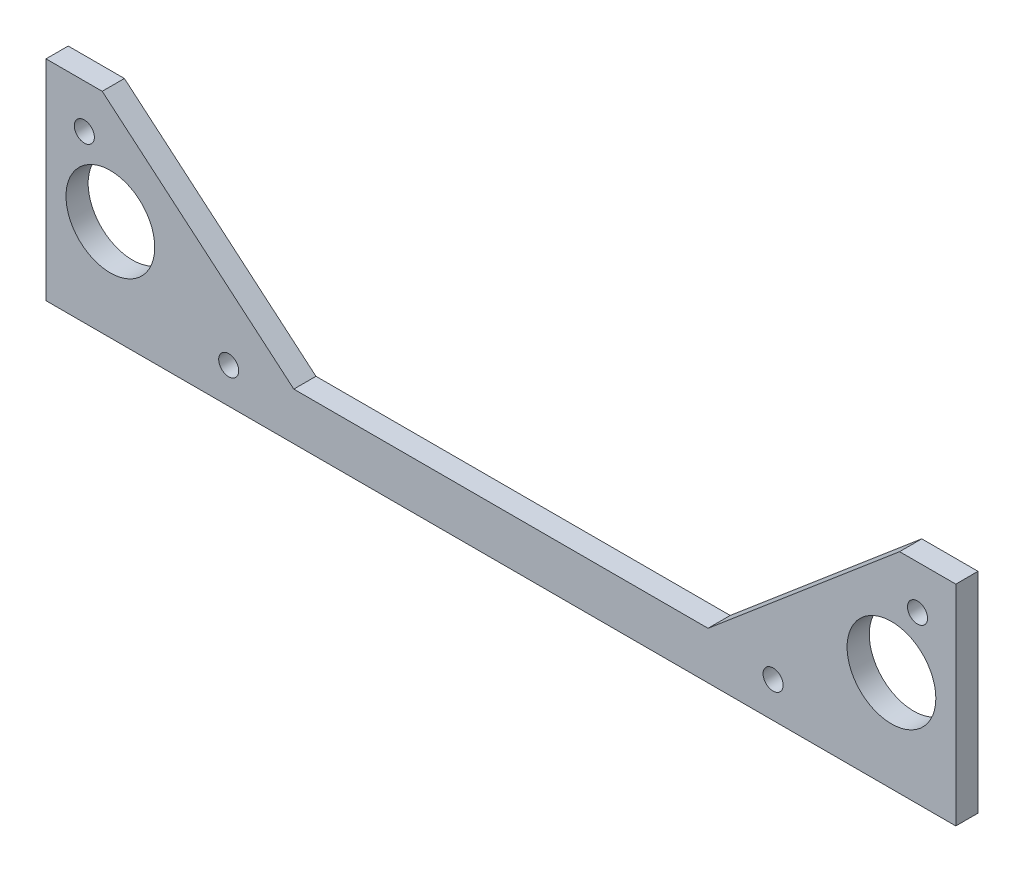
ISO-10303-21;
HEADER;
FILE_DESCRIPTION(('STEP AP214'),'2;1');
FILE_NAME('part.step','',(''),(''),'','','');
FILE_SCHEMA(('AUTOMOTIVE_DESIGN { 1 0 10303 214 1 1 1 1 }'));
ENDSEC;
DATA;
#1=APPLICATION_CONTEXT('core data for automotive mechanical design processes');
#2=APPLICATION_PROTOCOL_DEFINITION('international standard','automotive_design',2000,#1);
#3=PRODUCT_CONTEXT('',#1,'mechanical');
#4=PRODUCT('Part','Part','',(#3));
#5=PRODUCT_RELATED_PRODUCT_CATEGORY('part','',(#4));
#6=PRODUCT_DEFINITION_FORMATION('','',#4);
#7=PRODUCT_DEFINITION_CONTEXT('part definition',#1,'design');
#8=PRODUCT_DEFINITION('design','',#6,#7);
#9=PRODUCT_DEFINITION_SHAPE('','',#8);
#10=(LENGTH_UNIT() NAMED_UNIT(*) SI_UNIT(.MILLI.,.METRE.));
#11=(NAMED_UNIT(*) PLANE_ANGLE_UNIT() SI_UNIT($,.RADIAN.));
#12=(NAMED_UNIT(*) SI_UNIT($,.STERADIAN.) SOLID_ANGLE_UNIT());
#13=UNCERTAINTY_MEASURE_WITH_UNIT(LENGTH_MEASURE(1.E-05),#10,'distance_accuracy_value','');
#14=(GEOMETRIC_REPRESENTATION_CONTEXT(3) GLOBAL_UNCERTAINTY_ASSIGNED_CONTEXT((#13)) GLOBAL_UNIT_ASSIGNED_CONTEXT((#10,
#11,#12)) REPRESENTATION_CONTEXT('',''));
#15=CARTESIAN_POINT('',(0.,0.,0.));
#16=DIRECTION('',(0.,0.,1.));
#17=DIRECTION('',(1.,0.,0.));
#18=AXIS2_PLACEMENT_3D('',#15,#16,#17);
#19=CARTESIAN_POINT('',(0.,0.,4.7625));
#20=DIRECTION('',(0.,0.,1.));
#21=DIRECTION('',(1.,0.,0.));
#22=AXIS2_PLACEMENT_3D('',#19,#20,#21);
#23=PLANE('',#22);
#24=CARTESIAN_POINT('',(89.4079999999999,35.5599999999978,4.7625));
#25=DIRECTION('',(0.,0.,1.));
#26=DIRECTION('',(1.,0.,0.));
#27=AXIS2_PLACEMENT_3D('',#24,#25,#26);
#28=CIRCLE('',#27,2.15264999999999);
#29=CARTESIAN_POINT('',(91.5606499999999,35.5599999999978,4.7625));
#30=VERTEX_POINT('',#29);
#31=EDGE_CURVE('E227',#30,#30,#28,.T.);
#32=ORIENTED_EDGE('',*,*,#31,.F.);
#33=EDGE_LOOP('',(#32));
#34=FACE_BOUND('',#33,.T.);
#35=CARTESIAN_POINT('',(58.4199999999999,7.61999999999863,4.7625));
#36=DIRECTION('',(0.,0.,1.));
#37=DIRECTION('',(1.,0.,0.));
#38=AXIS2_PLACEMENT_3D('',#35,#36,#37);
#39=CIRCLE('',#38,2.15264999999999);
#40=CARTESIAN_POINT('',(60.5726499999999,7.61999999999863,4.7625));
#41=VERTEX_POINT('',#40);
#42=EDGE_CURVE('E221',#41,#41,#39,.T.);
#43=ORIENTED_EDGE('',*,*,#42,.F.);
#44=EDGE_LOOP('',(#43));
#45=FACE_BOUND('',#44,.T.);
#46=CARTESIAN_POINT('',(-58.4199999999996,7.61999999999818,4.7625));
#47=DIRECTION('',(0.,0.,1.));
#48=DIRECTION('',(1.,0.,0.));
#49=AXIS2_PLACEMENT_3D('',#46,#47,#48);
#50=CIRCLE('',#49,2.15264999999999);
#51=CARTESIAN_POINT('',(-56.2673499999996,7.61999999999818,4.7625));
#52=VERTEX_POINT('',#51);
#53=EDGE_CURVE('E215',#52,#52,#50,.T.);
#54=ORIENTED_EDGE('',*,*,#53,.F.);
#55=EDGE_LOOP('',(#54));
#56=FACE_BOUND('',#55,.T.);
#57=CARTESIAN_POINT('',(-89.4080000000001,35.5599999999978,4.7625));
#58=DIRECTION('',(0.,0.,1.));
#59=DIRECTION('',(1.,0.,0.));
#60=AXIS2_PLACEMENT_3D('',#57,#58,#59);
#61=CIRCLE('',#60,2.15264999999999);
#62=CARTESIAN_POINT('',(-87.2553500000001,35.5599999999978,4.7625));
#63=VERTEX_POINT('',#62);
#64=EDGE_CURVE('E209',#63,#63,#61,.T.);
#65=ORIENTED_EDGE('',*,*,#64,.F.);
#66=EDGE_LOOP('',(#65));
#67=FACE_BOUND('',#66,.T.);
#68=CARTESIAN_POINT('',(-83.8200000000003,21.5899999999987,4.7625));
#69=DIRECTION('',(0.,0.,1.));
#70=DIRECTION('',(1.,0.,0.));
#71=AXIS2_PLACEMENT_3D('',#68,#69,#70);
#72=CIRCLE('',#71,9.52500000000001);
#73=CARTESIAN_POINT('',(-74.2950000000003,21.5899999999987,4.7625));
#74=VERTEX_POINT('',#73);
#75=EDGE_CURVE('E150',#74,#74,#72,.T.);
#76=ORIENTED_EDGE('',*,*,#75,.F.);
#77=EDGE_LOOP('',(#76));
#78=FACE_BOUND('',#77,.T.);
#79=DIRECTION('',(-1.,0.,0.));
#80=VECTOR('',#79,1.);
#81=CARTESIAN_POINT('',(44.45,10.1599999999982,4.7625));
#82=LINE('',#81,#80);
#83=CARTESIAN_POINT('',(44.45,10.1599999999982,4.7625));
#84=VERTEX_POINT('',#83);
#85=CARTESIAN_POINT('',(-44.45,10.1599999999982,4.7625));
#86=VERTEX_POINT('',#85);
#87=EDGE_CURVE('E161',#84,#86,#82,.T.);
#88=ORIENTED_EDGE('',*,*,#87,.T.);
#89=DIRECTION('',(-0.763319207538048,0.646021506920232,0.));
#90=VECTOR('',#89,1.);
#91=CARTESIAN_POINT('',(-44.45,10.1599999999982,4.7625));
#92=LINE('',#91,#90);
#93=CARTESIAN_POINT('',(-85.5662500000001,44.9579999999982,4.7625));
#94=VERTEX_POINT('',#93);
#95=EDGE_CURVE('E109',#86,#94,#92,.T.);
#96=ORIENTED_EDGE('',*,*,#95,.T.);
#97=DIRECTION('',(-1.,0.,0.));
#98=VECTOR('',#97,1.);
#99=CARTESIAN_POINT('',(-85.5662500000001,44.9579999999982,4.7625));
#100=LINE('',#99,#98);
#101=CARTESIAN_POINT('',(-97.6312500000001,44.9579999999982,4.7625));
#102=VERTEX_POINT('',#101);
#103=EDGE_CURVE('E176',#94,#102,#100,.T.);
#104=ORIENTED_EDGE('',*,*,#103,.T.);
#105=DIRECTION('',(0.,-1.,0.));
#106=VECTOR('',#105,1.);
#107=CARTESIAN_POINT('',(-97.6312500000001,44.9579999999982,4.7625));
#108=LINE('',#107,#106);
#109=CARTESIAN_POINT('',(-97.6312500000002,-1.7837229068974E-12,4.7625));
#110=VERTEX_POINT('',#109);
#111=EDGE_CURVE('E189',#102,#110,#108,.T.);
#112=ORIENTED_EDGE('',*,*,#111,.T.);
#113=DIRECTION('',(1.,0.,0.));
#114=VECTOR('',#113,1.);
#115=CARTESIAN_POINT('',(-97.6312500000002,-1.7837229068974E-12,4.7625));
#116=LINE('',#115,#114);
#117=CARTESIAN_POINT('',(97.6312499999999,-1.76793328447214E-12,4.7625));
#118=VERTEX_POINT('',#117);
#119=EDGE_CURVE('E128',#110,#118,#116,.T.);
#120=ORIENTED_EDGE('',*,*,#119,.T.);
#121=DIRECTION('',(0.,1.,0.));
#122=VECTOR('',#121,1.);
#123=CARTESIAN_POINT('',(97.6312499999999,-1.76793328447214E-12,4.7625));
#124=LINE('',#123,#122);
#125=CARTESIAN_POINT('',(97.6312499999999,44.9579999999982,4.7625));
#126=VERTEX_POINT('',#125);
#127=EDGE_CURVE('E122',#118,#126,#124,.T.);
#128=ORIENTED_EDGE('',*,*,#127,.T.);
#129=DIRECTION('',(-1.,0.,0.));
#130=VECTOR('',#129,1.);
#131=CARTESIAN_POINT('',(97.6312499999999,44.9579999999982,4.7625));
#132=LINE('',#131,#130);
#133=CARTESIAN_POINT('',(85.5662499999999,44.9579999999982,4.7625));
#134=VERTEX_POINT('',#133);
#135=EDGE_CURVE('E126',#126,#134,#132,.T.);
#136=ORIENTED_EDGE('',*,*,#135,.T.);
#137=DIRECTION('',(-0.763319207538048,-0.646021506920232,0.));
#138=VECTOR('',#137,1.);
#139=CARTESIAN_POINT('',(85.5662499999999,44.9579999999982,4.7625));
#140=LINE('',#139,#138);
#141=EDGE_CURVE('E66',#134,#84,#140,.T.);
#142=ORIENTED_EDGE('',*,*,#141,.T.);
#143=EDGE_LOOP('',(#88,#96,#104,#112,#120,#128,#136,#142));
#144=FACE_BOUND('',#143,.T.);
#145=CARTESIAN_POINT('',(83.8199999999999,21.5899999999984,4.7625));
#146=DIRECTION('',(0.,0.,1.));
#147=DIRECTION('',(1.,0.,0.));
#148=AXIS2_PLACEMENT_3D('',#145,#146,#147);
#149=CIRCLE('',#148,9.52500000000001);
#150=CARTESIAN_POINT('',(93.3449999999999,21.5899999999984,4.7625));
#151=VERTEX_POINT('',#150);
#152=EDGE_CURVE('E198',#151,#151,#149,.T.);
#153=ORIENTED_EDGE('',*,*,#152,.F.);
#154=EDGE_LOOP('',(#153));
#155=FACE_BOUND('',#154,.T.);
#156=ADVANCED_FACE('F49',(#34,#45,#56,#67,#78,#144,#155),#23,.T.);
#157=CARTESIAN_POINT('',(0.,0.,0.));
#158=DIRECTION('',(0.,0.,1.));
#159=DIRECTION('',(1.,0.,0.));
#160=AXIS2_PLACEMENT_3D('',#157,#158,#159);
#161=PLANE('',#160);
#162=CARTESIAN_POINT('',(89.4079999999999,35.5599999999978,0.));
#163=DIRECTION('',(0.,0.,1.));
#164=DIRECTION('',(1.,0.,0.));
#165=AXIS2_PLACEMENT_3D('',#162,#163,#164);
#166=CIRCLE('',#165,2.15264999999999);
#167=CARTESIAN_POINT('',(91.5606499999999,35.5599999999978,0.));
#168=VERTEX_POINT('',#167);
#169=EDGE_CURVE('E224',#168,#168,#166,.T.);
#170=ORIENTED_EDGE('',*,*,#169,.T.);
#171=EDGE_LOOP('',(#170));
#172=FACE_BOUND('',#171,.T.);
#173=CARTESIAN_POINT('',(58.4199999999999,7.61999999999863,0.));
#174=DIRECTION('',(0.,0.,1.));
#175=DIRECTION('',(1.,0.,0.));
#176=AXIS2_PLACEMENT_3D('',#173,#174,#175);
#177=CIRCLE('',#176,2.15265);
#178=CARTESIAN_POINT('',(60.5726499999999,7.61999999999863,0.));
#179=VERTEX_POINT('',#178);
#180=EDGE_CURVE('E218',#179,#179,#177,.T.);
#181=ORIENTED_EDGE('',*,*,#180,.T.);
#182=EDGE_LOOP('',(#181));
#183=FACE_BOUND('',#182,.T.);
#184=CARTESIAN_POINT('',(-58.4199999999996,7.61999999999818,0.));
#185=DIRECTION('',(0.,0.,1.));
#186=DIRECTION('',(1.,0.,0.));
#187=AXIS2_PLACEMENT_3D('',#184,#185,#186);
#188=CIRCLE('',#187,2.15265);
#189=CARTESIAN_POINT('',(-56.2673499999996,7.61999999999818,0.));
#190=VERTEX_POINT('',#189);
#191=EDGE_CURVE('E212',#190,#190,#188,.T.);
#192=ORIENTED_EDGE('',*,*,#191,.T.);
#193=EDGE_LOOP('',(#192));
#194=FACE_BOUND('',#193,.T.);
#195=CARTESIAN_POINT('',(-89.4080000000001,35.5599999999978,0.));
#196=DIRECTION('',(0.,0.,1.));
#197=DIRECTION('',(1.,0.,0.));
#198=AXIS2_PLACEMENT_3D('',#195,#196,#197);
#199=CIRCLE('',#198,2.15264999999999);
#200=CARTESIAN_POINT('',(-87.2553500000001,35.5599999999978,0.));
#201=VERTEX_POINT('',#200);
#202=EDGE_CURVE('E204',#201,#201,#199,.T.);
#203=ORIENTED_EDGE('',*,*,#202,.T.);
#204=EDGE_LOOP('',(#203));
#205=FACE_BOUND('',#204,.T.);
#206=DIRECTION('',(-1.,0.,0.));
#207=VECTOR('',#206,1.);
#208=CARTESIAN_POINT('',(44.45,10.1599999999982,0.));
#209=LINE('',#208,#207);
#210=CARTESIAN_POINT('',(44.45,10.1599999999982,0.));
#211=VERTEX_POINT('',#210);
#212=CARTESIAN_POINT('',(-44.45,10.1599999999982,0.));
#213=VERTEX_POINT('',#212);
#214=EDGE_CURVE('E146',#211,#213,#209,.T.);
#215=ORIENTED_EDGE('',*,*,#214,.F.);
#216=DIRECTION('',(-0.763319207538048,-0.646021506920232,0.));
#217=VECTOR('',#216,1.);
#218=CARTESIAN_POINT('',(85.5662499999999,44.9579999999982,0.));
#219=LINE('',#218,#217);
#220=CARTESIAN_POINT('',(85.5662499999999,44.9579999999982,0.));
#221=VERTEX_POINT('',#220);
#222=EDGE_CURVE('E101',#221,#211,#219,.T.);
#223=ORIENTED_EDGE('',*,*,#222,.F.);
#224=DIRECTION('',(-1.,0.,0.));
#225=VECTOR('',#224,1.);
#226=CARTESIAN_POINT('',(97.6312499999999,44.9579999999982,0.));
#227=LINE('',#226,#225);
#228=CARTESIAN_POINT('',(97.6312499999999,44.9579999999982,0.));
#229=VERTEX_POINT('',#228);
#230=EDGE_CURVE('E95',#229,#221,#227,.T.);
#231=ORIENTED_EDGE('',*,*,#230,.F.);
#232=DIRECTION('',(0.,1.,0.));
#233=VECTOR('',#232,1.);
#234=CARTESIAN_POINT('',(97.6312499999999,-1.76793328447214E-12,0.));
#235=LINE('',#234,#233);
#236=CARTESIAN_POINT('',(97.6312499999999,-1.76793328447214E-12,0.));
#237=VERTEX_POINT('',#236);
#238=EDGE_CURVE('E136',#237,#229,#235,.T.);
#239=ORIENTED_EDGE('',*,*,#238,.F.);
#240=DIRECTION('',(1.,0.,0.));
#241=VECTOR('',#240,1.);
#242=CARTESIAN_POINT('',(-97.6312500000002,-1.7837229068974E-12,0.));
#243=LINE('',#242,#241);
#244=CARTESIAN_POINT('',(-97.6312500000002,-1.7837229068974E-12,0.));
#245=VERTEX_POINT('',#244);
#246=EDGE_CURVE('E156',#245,#237,#243,.T.);
#247=ORIENTED_EDGE('',*,*,#246,.F.);
#248=DIRECTION('',(0.,-1.,0.));
#249=VECTOR('',#248,1.);
#250=CARTESIAN_POINT('',(-97.6312500000001,44.9579999999982,0.));
#251=LINE('',#250,#249);
#252=CARTESIAN_POINT('',(-97.6312500000001,44.9579999999982,0.));
#253=VERTEX_POINT('',#252);
#254=EDGE_CURVE('E154',#253,#245,#251,.T.);
#255=ORIENTED_EDGE('',*,*,#254,.F.);
#256=DIRECTION('',(-1.,0.,0.));
#257=VECTOR('',#256,1.);
#258=CARTESIAN_POINT('',(-85.5662500000001,44.9579999999982,0.));
#259=LINE('',#258,#257);
#260=CARTESIAN_POINT('',(-85.5662500000001,44.9579999999982,0.));
#261=VERTEX_POINT('',#260);
#262=EDGE_CURVE('E152',#261,#253,#259,.T.);
#263=ORIENTED_EDGE('',*,*,#262,.F.);
#264=DIRECTION('',(-0.763319207538048,0.646021506920232,0.));
#265=VECTOR('',#264,1.);
#266=CARTESIAN_POINT('',(-44.45,10.1599999999982,0.));
#267=LINE('',#266,#265);
#268=EDGE_CURVE('E149',#213,#261,#267,.T.);
#269=ORIENTED_EDGE('',*,*,#268,.F.);
#270=EDGE_LOOP('',(#215,#223,#231,#239,#247,#255,#263,#269));
#271=FACE_BOUND('',#270,.T.);
#272=CARTESIAN_POINT('',(-83.8200000000003,21.5899999999987,0.));
#273=DIRECTION('',(0.,0.,1.));
#274=DIRECTION('',(1.,0.,0.));
#275=AXIS2_PLACEMENT_3D('',#272,#273,#274);
#276=CIRCLE('',#275,9.52500000000001);
#277=CARTESIAN_POINT('',(-74.2950000000003,21.5899999999987,0.));
#278=VERTEX_POINT('',#277);
#279=EDGE_CURVE('E195',#278,#278,#276,.T.);
#280=ORIENTED_EDGE('',*,*,#279,.T.);
#281=EDGE_LOOP('',(#280));
#282=FACE_BOUND('',#281,.T.);
#283=CARTESIAN_POINT('',(83.8199999999999,21.5899999999984,0.));
#284=DIRECTION('',(0.,0.,1.));
#285=DIRECTION('',(1.,0.,0.));
#286=AXIS2_PLACEMENT_3D('',#283,#284,#285);
#287=CIRCLE('',#286,9.52500000000001);
#288=CARTESIAN_POINT('',(93.3449999999999,21.5899999999984,0.));
#289=VERTEX_POINT('',#288);
#290=EDGE_CURVE('E201',#289,#289,#287,.T.);
#291=ORIENTED_EDGE('',*,*,#290,.T.);
#292=EDGE_LOOP('',(#291));
#293=FACE_BOUND('',#292,.T.);
#294=ADVANCED_FACE('F180',(#172,#183,#194,#205,#271,#282,#293),#161,.F.);
#295=CARTESIAN_POINT('',(44.45,10.1599999999982,4.7625));
#296=DIRECTION('',(0.,-1.,0.));
#297=DIRECTION('',(1.,0.,0.));
#298=AXIS2_PLACEMENT_3D('',#295,#296,#297);
#299=PLANE('',#298);
#300=ORIENTED_EDGE('',*,*,#214,.T.);
#301=DIRECTION('',(0.,0.,-1.));
#302=VECTOR('',#301,1.);
#303=CARTESIAN_POINT('',(-44.45,10.1599999999982,4.7625));
#304=LINE('',#303,#302);
#305=EDGE_CURVE('E13',#86,#213,#304,.T.);
#306=ORIENTED_EDGE('',*,*,#305,.F.);
#307=ORIENTED_EDGE('',*,*,#87,.F.);
#308=DIRECTION('',(0.,0.,-1.));
#309=VECTOR('',#308,1.);
#310=CARTESIAN_POINT('',(44.45,10.1599999999982,4.7625));
#311=LINE('',#310,#309);
#312=EDGE_CURVE('E142',#84,#211,#311,.T.);
#313=ORIENTED_EDGE('',*,*,#312,.T.);
#314=EDGE_LOOP('',(#300,#306,#307,#313));
#315=FACE_BOUND('',#314,.T.);
#316=ADVANCED_FACE('F51',(#315),#299,.F.);
#317=CARTESIAN_POINT('',(-44.45,10.1599999999982,4.7625));
#318=DIRECTION('',(-0.646021506920232,-0.763319207538048,0.));
#319=DIRECTION('',(0.763319207538048,-0.646021506920232,0.));
#320=AXIS2_PLACEMENT_3D('',#317,#318,#319);
#321=PLANE('',#320);
#322=ORIENTED_EDGE('',*,*,#268,.T.);
#323=DIRECTION('',(0.,0.,-1.));
#324=VECTOR('',#323,1.);
#325=CARTESIAN_POINT('',(-85.5662500000001,44.9579999999982,4.7625));
#326=LINE('',#325,#324);
#327=EDGE_CURVE('E58',#94,#261,#326,.T.);
#328=ORIENTED_EDGE('',*,*,#327,.F.);
#329=ORIENTED_EDGE('',*,*,#95,.F.);
#330=ORIENTED_EDGE('',*,*,#305,.T.);
#331=EDGE_LOOP('',(#322,#328,#329,#330));
#332=FACE_BOUND('',#331,.T.);
#333=ADVANCED_FACE('F280',(#332),#321,.F.);
#334=CARTESIAN_POINT('',(-85.5662500000001,44.9579999999982,4.7625));
#335=DIRECTION('',(0.,-1.,0.));
#336=DIRECTION('',(0.,0.,-1.));
#337=AXIS2_PLACEMENT_3D('',#334,#335,#336);
#338=PLANE('',#337);
#339=ORIENTED_EDGE('',*,*,#262,.T.);
#340=DIRECTION('',(0.,0.,-1.));
#341=VECTOR('',#340,1.);
#342=CARTESIAN_POINT('',(-97.6312500000001,44.9579999999982,4.7625));
#343=LINE('',#342,#341);
#344=EDGE_CURVE('E168',#102,#253,#343,.T.);
#345=ORIENTED_EDGE('',*,*,#344,.F.);
#346=ORIENTED_EDGE('',*,*,#103,.F.);
#347=ORIENTED_EDGE('',*,*,#327,.T.);
#348=EDGE_LOOP('',(#339,#345,#346,#347));
#349=FACE_BOUND('',#348,.T.);
#350=ADVANCED_FACE('F174',(#349),#338,.F.);
#351=CARTESIAN_POINT('',(-97.6312500000001,44.9579999999982,4.7625));
#352=DIRECTION('',(1.,0.,0.));
#353=DIRECTION('',(0.,1.,0.));
#354=AXIS2_PLACEMENT_3D('',#351,#352,#353);
#355=PLANE('',#354);
#356=ORIENTED_EDGE('',*,*,#254,.T.);
#357=DIRECTION('',(0.,0.,-1.));
#358=VECTOR('',#357,1.);
#359=CARTESIAN_POINT('',(-97.6312500000002,-1.7837229068974E-12,4.7625));
#360=LINE('',#359,#358);
#361=EDGE_CURVE('E165',#110,#245,#360,.T.);
#362=ORIENTED_EDGE('',*,*,#361,.F.);
#363=ORIENTED_EDGE('',*,*,#111,.F.);
#364=ORIENTED_EDGE('',*,*,#344,.T.);
#365=EDGE_LOOP('',(#356,#362,#363,#364));
#366=FACE_BOUND('',#365,.T.);
#367=ADVANCED_FACE('F185',(#366),#355,.F.);
#368=CARTESIAN_POINT('',(-97.6312500000002,-1.7837229068974E-12,4.7625));
#369=DIRECTION('',(0.,1.,0.));
#370=DIRECTION('',(-1.,0.,0.));
#371=AXIS2_PLACEMENT_3D('',#368,#369,#370);
#372=PLANE('',#371);
#373=ORIENTED_EDGE('',*,*,#246,.T.);
#374=DIRECTION('',(0.,0.,-1.));
#375=VECTOR('',#374,1.);
#376=CARTESIAN_POINT('',(97.6312499999999,-1.76793328447214E-12,4.7625));
#377=LINE('',#376,#375);
#378=EDGE_CURVE('E137',#118,#237,#377,.T.);
#379=ORIENTED_EDGE('',*,*,#378,.F.);
#380=ORIENTED_EDGE('',*,*,#119,.F.);
#381=ORIENTED_EDGE('',*,*,#361,.T.);
#382=EDGE_LOOP('',(#373,#379,#380,#381));
#383=FACE_BOUND('',#382,.T.);
#384=ADVANCED_FACE('F188',(#383),#372,.F.);
#385=CARTESIAN_POINT('',(97.6312499999999,-1.76793328447214E-12,4.7625));
#386=DIRECTION('',(-1.,0.,0.));
#387=DIRECTION('',(0.,-1.,0.));
#388=AXIS2_PLACEMENT_3D('',#385,#386,#387);
#389=PLANE('',#388);
#390=ORIENTED_EDGE('',*,*,#238,.T.);
#391=DIRECTION('',(0.,0.,-1.));
#392=VECTOR('',#391,1.);
#393=CARTESIAN_POINT('',(97.6312499999999,44.9579999999982,4.7625));
#394=LINE('',#393,#392);
#395=EDGE_CURVE('E133',#126,#229,#394,.T.);
#396=ORIENTED_EDGE('',*,*,#395,.F.);
#397=ORIENTED_EDGE('',*,*,#127,.F.);
#398=ORIENTED_EDGE('',*,*,#378,.T.);
#399=EDGE_LOOP('',(#390,#396,#397,#398));
#400=FACE_BOUND('',#399,.T.);
#401=ADVANCED_FACE('F134',(#400),#389,.F.);
#402=CARTESIAN_POINT('',(97.6312499999999,44.9579999999982,4.7625));
#403=DIRECTION('',(0.,-1.,0.));
#404=DIRECTION('',(0.,0.,-1.));
#405=AXIS2_PLACEMENT_3D('',#402,#403,#404);
#406=PLANE('',#405);
#407=ORIENTED_EDGE('',*,*,#230,.T.);
#408=DIRECTION('',(0.,0.,-1.));
#409=VECTOR('',#408,1.);
#410=CARTESIAN_POINT('',(85.5662499999999,44.9579999999982,4.7625));
#411=LINE('',#410,#409);
#412=EDGE_CURVE('E138',#134,#221,#411,.T.);
#413=ORIENTED_EDGE('',*,*,#412,.F.);
#414=ORIENTED_EDGE('',*,*,#135,.F.);
#415=ORIENTED_EDGE('',*,*,#395,.T.);
#416=EDGE_LOOP('',(#407,#413,#414,#415));
#417=FACE_BOUND('',#416,.T.);
#418=ADVANCED_FACE('F140',(#417),#406,.F.);
#419=CARTESIAN_POINT('',(85.5662499999999,44.9579999999982,4.7625));
#420=DIRECTION('',(0.646021506920232,-0.763319207538048,0.));
#421=DIRECTION('',(0.763319207538048,0.646021506920232,0.));
#422=AXIS2_PLACEMENT_3D('',#419,#420,#421);
#423=PLANE('',#422);
#424=ORIENTED_EDGE('',*,*,#222,.T.);
#425=ORIENTED_EDGE('',*,*,#312,.F.);
#426=ORIENTED_EDGE('',*,*,#141,.F.);
#427=ORIENTED_EDGE('',*,*,#412,.T.);
#428=EDGE_LOOP('',(#424,#425,#426,#427));
#429=FACE_BOUND('',#428,.T.);
#430=ADVANCED_FACE('F248',(#429),#423,.F.);
#431=CARTESIAN_POINT('',(-83.8200000000003,21.5899999999987,4.7625));
#432=DIRECTION('',(0.,0.,-1.));
#433=DIRECTION('',(-1.,0.,0.));
#434=AXIS2_PLACEMENT_3D('',#431,#432,#433);
#435=CYLINDRICAL_SURFACE('',#434,9.52500000000001);
#436=ORIENTED_EDGE('',*,*,#75,.T.);
#437=EDGE_LOOP('',(#436));
#438=FACE_BOUND('',#437,.T.);
#439=ORIENTED_EDGE('',*,*,#279,.F.);
#440=EDGE_LOOP('',(#439));
#441=FACE_BOUND('',#440,.T.);
#442=ADVANCED_FACE('F244',(#438,#441),#435,.F.);
#443=CARTESIAN_POINT('',(83.8199999999999,21.5899999999984,4.7625));
#444=DIRECTION('',(0.,0.,-1.));
#445=DIRECTION('',(-1.,0.,0.));
#446=AXIS2_PLACEMENT_3D('',#443,#444,#445);
#447=CYLINDRICAL_SURFACE('',#446,9.52500000000001);
#448=ORIENTED_EDGE('',*,*,#152,.T.);
#449=EDGE_LOOP('',(#448));
#450=FACE_BOUND('',#449,.T.);
#451=ORIENTED_EDGE('',*,*,#290,.F.);
#452=EDGE_LOOP('',(#451));
#453=FACE_BOUND('',#452,.T.);
#454=ADVANCED_FACE('F247',(#450,#453),#447,.F.);
#455=CARTESIAN_POINT('',(-89.4080000000001,35.5599999999978,4.7625));
#456=DIRECTION('',(0.,0.,1.));
#457=DIRECTION('',(1.,0.,0.));
#458=AXIS2_PLACEMENT_3D('',#455,#456,#457);
#459=CYLINDRICAL_SURFACE('',#458,2.15264999999999);
#460=ORIENTED_EDGE('',*,*,#202,.F.);
#461=EDGE_LOOP('',(#460));
#462=FACE_BOUND('',#461,.T.);
#463=ORIENTED_EDGE('',*,*,#64,.T.);
#464=EDGE_LOOP('',(#463));
#465=FACE_BOUND('',#464,.T.);
#466=ADVANCED_FACE('F258',(#462,#465),#459,.F.);
#467=CARTESIAN_POINT('',(-58.4199999999996,7.61999999999818,4.7625));
#468=DIRECTION('',(0.,0.,1.));
#469=DIRECTION('',(1.,0.,0.));
#470=AXIS2_PLACEMENT_3D('',#467,#468,#469);
#471=CYLINDRICAL_SURFACE('',#470,2.15265);
#472=ORIENTED_EDGE('',*,*,#191,.F.);
#473=EDGE_LOOP('',(#472));
#474=FACE_BOUND('',#473,.T.);
#475=ORIENTED_EDGE('',*,*,#53,.T.);
#476=EDGE_LOOP('',(#475));
#477=FACE_BOUND('',#476,.T.);
#478=ADVANCED_FACE('F264',(#474,#477),#471,.F.);
#479=CARTESIAN_POINT('',(58.4199999999999,7.61999999999863,4.7625));
#480=DIRECTION('',(0.,0.,1.));
#481=DIRECTION('',(1.,0.,0.));
#482=AXIS2_PLACEMENT_3D('',#479,#480,#481);
#483=CYLINDRICAL_SURFACE('',#482,2.15265);
#484=ORIENTED_EDGE('',*,*,#180,.F.);
#485=EDGE_LOOP('',(#484));
#486=FACE_BOUND('',#485,.T.);
#487=ORIENTED_EDGE('',*,*,#42,.T.);
#488=EDGE_LOOP('',(#487));
#489=FACE_BOUND('',#488,.T.);
#490=ADVANCED_FACE('F341',(#486,#489),#483,.F.);
#491=CARTESIAN_POINT('',(89.4079999999999,35.5599999999978,4.7625));
#492=DIRECTION('',(0.,0.,1.));
#493=DIRECTION('',(1.,0.,0.));
#494=AXIS2_PLACEMENT_3D('',#491,#492,#493);
#495=CYLINDRICAL_SURFACE('',#494,2.15264999999999);
#496=ORIENTED_EDGE('',*,*,#169,.F.);
#497=EDGE_LOOP('',(#496));
#498=FACE_BOUND('',#497,.T.);
#499=ORIENTED_EDGE('',*,*,#31,.T.);
#500=EDGE_LOOP('',(#499));
#501=FACE_BOUND('',#500,.T.);
#502=ADVANCED_FACE('F231',(#498,#501),#495,.F.);
#503=CLOSED_SHELL('',(#156,#294,#316,#333,#350,#367,#384,#401,#418,#430,#442,#454,#466,#478,
#490,#502));
#504=MANIFOLD_SOLID_BREP('B2',#503);
#505=ADVANCED_BREP_SHAPE_REPRESENTATION('',(#18,#504),#14);
#506=SHAPE_DEFINITION_REPRESENTATION(#9,#505);
ENDSEC;
END-ISO-10303-21;
